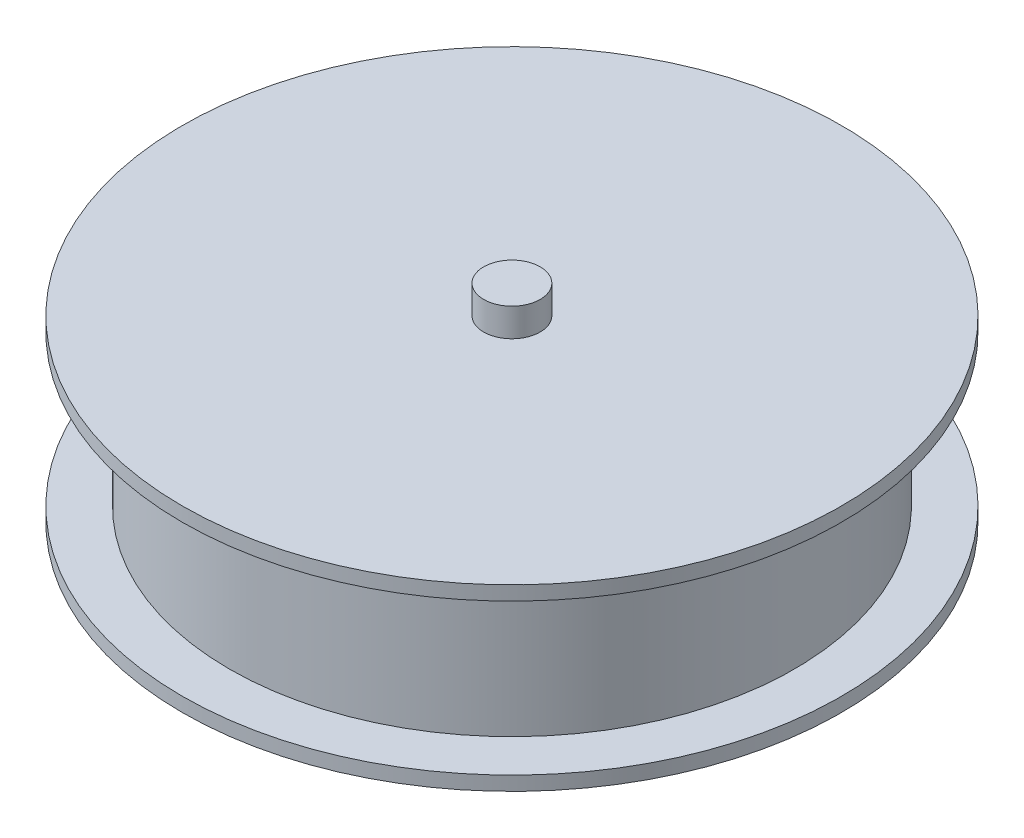
ISO-10303-21;
HEADER;
FILE_DESCRIPTION(('STEP AP214'),'2;1');
FILE_NAME('part.step','',(''),(''),'','','');
FILE_SCHEMA(('AUTOMOTIVE_DESIGN { 1 0 10303 214 1 1 1 1 }'));
ENDSEC;
DATA;
#1=APPLICATION_CONTEXT('core data for automotive mechanical design processes');
#2=APPLICATION_PROTOCOL_DEFINITION('international standard','automotive_design',2000,#1);
#3=PRODUCT_CONTEXT('',#1,'mechanical');
#4=PRODUCT('Part','Part','',(#3));
#5=PRODUCT_RELATED_PRODUCT_CATEGORY('part','',(#4));
#6=PRODUCT_DEFINITION_FORMATION('','',#4);
#7=PRODUCT_DEFINITION_CONTEXT('part definition',#1,'design');
#8=PRODUCT_DEFINITION('design','',#6,#7);
#9=PRODUCT_DEFINITION_SHAPE('','',#8);
#10=(LENGTH_UNIT() NAMED_UNIT(*) SI_UNIT(.MILLI.,.METRE.));
#11=(NAMED_UNIT(*) PLANE_ANGLE_UNIT() SI_UNIT($,.RADIAN.));
#12=(NAMED_UNIT(*) SI_UNIT($,.STERADIAN.) SOLID_ANGLE_UNIT());
#13=UNCERTAINTY_MEASURE_WITH_UNIT(LENGTH_MEASURE(1.E-05),#10,'distance_accuracy_value','');
#14=(GEOMETRIC_REPRESENTATION_CONTEXT(3) GLOBAL_UNCERTAINTY_ASSIGNED_CONTEXT((#13)) GLOBAL_UNIT_ASSIGNED_CONTEXT((#10,
#11,#12)) REPRESENTATION_CONTEXT('',''));
#15=CARTESIAN_POINT('',(0.,0.,0.));
#16=DIRECTION('',(0.,0.,1.));
#17=DIRECTION('',(1.,0.,0.));
#18=AXIS2_PLACEMENT_3D('',#15,#16,#17);
#19=CARTESIAN_POINT('',(0.,22.,0.));
#20=DIRECTION('',(0.,-1.,0.));
#21=DIRECTION('',(0.,0.,-1.));
#22=AXIS2_PLACEMENT_3D('',#19,#20,#21);
#23=CYLINDRICAL_SURFACE('',#22,3.);
#24=CARTESIAN_POINT('',(0.,22.,0.));
#25=DIRECTION('',(0.,1.,0.));
#26=DIRECTION('',(0.,0.,1.));
#27=AXIS2_PLACEMENT_3D('',#24,#25,#26);
#28=CIRCLE('',#27,3.);
#29=CARTESIAN_POINT('',(0.,22.,3.));
#30=VERTEX_POINT('',#29);
#31=EDGE_CURVE('E11',#30,#30,#28,.T.);
#32=ORIENTED_EDGE('',*,*,#31,.F.);
#33=EDGE_LOOP('',(#32));
#34=FACE_BOUND('',#33,.T.);
#35=CARTESIAN_POINT('',(0.,19.,0.));
#36=DIRECTION('',(0.,1.,0.));
#37=DIRECTION('',(0.,0.,1.));
#38=AXIS2_PLACEMENT_3D('',#35,#36,#37);
#39=CIRCLE('',#38,3.);
#40=CARTESIAN_POINT('',(0.,19.,3.));
#41=VERTEX_POINT('',#40);
#42=EDGE_CURVE('E52',#41,#41,#39,.T.);
#43=ORIENTED_EDGE('',*,*,#42,.T.);
#44=EDGE_LOOP('',(#43));
#45=FACE_BOUND('',#44,.T.);
#46=ADVANCED_FACE('F49',(#34,#45),#23,.T.);
#47=CARTESIAN_POINT('',(0.,22.,0.));
#48=DIRECTION('',(0.,1.,0.));
#49=DIRECTION('',(0.,0.,1.));
#50=AXIS2_PLACEMENT_3D('',#47,#48,#49);
#51=PLANE('',#50);
#52=ORIENTED_EDGE('',*,*,#31,.T.);
#53=EDGE_LOOP('',(#52));
#54=FACE_BOUND('',#53,.T.);
#55=ADVANCED_FACE('F64',(#54),#51,.T.);
#56=CARTESIAN_POINT('',(0.,19.,0.));
#57=DIRECTION('',(0.,1.,0.));
#58=DIRECTION('',(0.,0.,1.));
#59=AXIS2_PLACEMENT_3D('',#56,#57,#58);
#60=PLANE('',#59);
#61=ORIENTED_EDGE('',*,*,#42,.F.);
#62=EDGE_LOOP('',(#61));
#63=FACE_BOUND('',#62,.T.);
#64=ADVANCED_FACE('F62',(#63),#60,.F.);
#65=CLOSED_SHELL('',(#46,#55,#64));
#66=MANIFOLD_SOLID_BREP('B2',#65);
#67=CARTESIAN_POINT('',(0.,1.5,0.));
#68=DIRECTION('',(0.,-1.,0.));
#69=DIRECTION('',(0.,0.,-1.));
#70=AXIS2_PLACEMENT_3D('',#67,#68,#69);
#71=CYLINDRICAL_SURFACE('',#70,35.);
#72=CARTESIAN_POINT('',(0.,1.5,0.));
#73=DIRECTION('',(0.,1.,0.));
#74=DIRECTION('',(0.,0.,1.));
#75=AXIS2_PLACEMENT_3D('',#72,#73,#74);
#76=CIRCLE('',#75,35.);
#77=CARTESIAN_POINT('',(0.,1.5,35.));
#78=VERTEX_POINT('',#77);
#79=EDGE_CURVE('E104',#78,#78,#76,.T.);
#80=ORIENTED_EDGE('',*,*,#79,.F.);
#81=EDGE_LOOP('',(#80));
#82=FACE_BOUND('',#81,.T.);
#83=CARTESIAN_POINT('',(0.,0.,0.));
#84=DIRECTION('',(0.,1.,0.));
#85=DIRECTION('',(0.,0.,1.));
#86=AXIS2_PLACEMENT_3D('',#83,#84,#85);
#87=CIRCLE('',#86,35.);
#88=CARTESIAN_POINT('',(0.,0.,35.));
#89=VERTEX_POINT('',#88);
#90=EDGE_CURVE('E99',#89,#89,#87,.T.);
#91=ORIENTED_EDGE('',*,*,#90,.T.);
#92=EDGE_LOOP('',(#91));
#93=FACE_BOUND('',#92,.T.);
#94=ADVANCED_FACE('F96',(#82,#93),#71,.T.);
#95=CARTESIAN_POINT('',(0.,1.5,0.));
#96=DIRECTION('',(0.,1.,0.));
#97=DIRECTION('',(0.,0.,1.));
#98=AXIS2_PLACEMENT_3D('',#95,#96,#97);
#99=PLANE('',#98);
#100=CARTESIAN_POINT('',(0.,1.5,0.));
#101=DIRECTION('',(0.,1.,0.));
#102=DIRECTION('',(0.,0.,1.));
#103=AXIS2_PLACEMENT_3D('',#100,#101,#102);
#104=CIRCLE('',#103,30.);
#105=CARTESIAN_POINT('',(0.,1.5,30.));
#106=VERTEX_POINT('',#105);
#107=EDGE_CURVE('E48',#106,#106,#104,.T.);
#108=ORIENTED_EDGE('',*,*,#107,.F.);
#109=EDGE_LOOP('',(#108));
#110=FACE_BOUND('',#109,.T.);
#111=ORIENTED_EDGE('',*,*,#79,.T.);
#112=EDGE_LOOP('',(#111));
#113=FACE_BOUND('',#112,.T.);
#114=ADVANCED_FACE('F156',(#110,#113),#99,.T.);
#115=CARTESIAN_POINT('',(0.,0.,0.));
#116=DIRECTION('',(0.,1.,0.));
#117=DIRECTION('',(0.,0.,1.));
#118=AXIS2_PLACEMENT_3D('',#115,#116,#117);
#119=PLANE('',#118);
#120=CARTESIAN_POINT('',(0.,0.,0.));
#121=DIRECTION('',(0.,1.,0.));
#122=DIRECTION('',(0.,0.,1.));
#123=AXIS2_PLACEMENT_3D('',#120,#121,#122);
#124=CIRCLE('',#123,3.);
#125=CARTESIAN_POINT('',(0.,0.,3.));
#126=VERTEX_POINT('',#125);
#127=EDGE_CURVE('E116',#126,#126,#124,.T.);
#128=ORIENTED_EDGE('',*,*,#127,.T.);
#129=EDGE_LOOP('',(#128));
#130=FACE_BOUND('',#129,.T.);
#131=ORIENTED_EDGE('',*,*,#90,.F.);
#132=EDGE_LOOP('',(#131));
#133=FACE_BOUND('',#132,.T.);
#134=ADVANCED_FACE('F153',(#130,#133),#119,.F.);
#135=CARTESIAN_POINT('',(0.,9.5,0.));
#136=DIRECTION('',(0.,-1.,0.));
#137=DIRECTION('',(0.,0.,-1.));
#138=AXIS2_PLACEMENT_3D('',#135,#136,#137);
#139=CYLINDRICAL_SURFACE('',#138,30.);
#140=ORIENTED_EDGE('',*,*,#107,.T.);
#141=EDGE_LOOP('',(#140));
#142=FACE_BOUND('',#141,.T.);
#143=CARTESIAN_POINT('',(0.,17.5,0.));
#144=DIRECTION('',(0.,1.,0.));
#145=DIRECTION('',(0.,0.,1.));
#146=AXIS2_PLACEMENT_3D('',#143,#144,#145);
#147=CIRCLE('',#146,30.);
#148=CARTESIAN_POINT('',(0.,17.5,30.));
#149=VERTEX_POINT('',#148);
#150=EDGE_CURVE('E120',#149,#149,#147,.T.);
#151=ORIENTED_EDGE('',*,*,#150,.F.);
#152=EDGE_LOOP('',(#151));
#153=FACE_BOUND('',#152,.T.);
#154=ADVANCED_FACE('F144',(#142,#153),#139,.T.);
#155=CARTESIAN_POINT('',(0.,17.5,0.));
#156=DIRECTION('',(0.,1.,0.));
#157=DIRECTION('',(0.,0.,-1.));
#158=AXIS2_PLACEMENT_3D('',#155,#156,#157);
#159=CYLINDRICAL_SURFACE('',#158,35.);
#160=CARTESIAN_POINT('',(0.,17.5,0.));
#161=DIRECTION('',(0.,1.,0.));
#162=DIRECTION('',(0.,0.,1.));
#163=AXIS2_PLACEMENT_3D('',#160,#161,#162);
#164=CIRCLE('',#163,35.);
#165=CARTESIAN_POINT('',(0.,17.5,35.));
#166=VERTEX_POINT('',#165);
#167=EDGE_CURVE('E115',#166,#166,#164,.T.);
#168=ORIENTED_EDGE('',*,*,#167,.T.);
#169=EDGE_LOOP('',(#168));
#170=FACE_BOUND('',#169,.T.);
#171=CARTESIAN_POINT('',(0.,19.,0.));
#172=DIRECTION('',(0.,1.,0.));
#173=DIRECTION('',(0.,0.,1.));
#174=AXIS2_PLACEMENT_3D('',#171,#172,#173);
#175=CIRCLE('',#174,35.);
#176=CARTESIAN_POINT('',(0.,19.,35.));
#177=VERTEX_POINT('',#176);
#178=EDGE_CURVE('E111',#177,#177,#175,.T.);
#179=ORIENTED_EDGE('',*,*,#178,.F.);
#180=EDGE_LOOP('',(#179));
#181=FACE_BOUND('',#180,.T.);
#182=ADVANCED_FACE('F142',(#170,#181),#159,.T.);
#183=CARTESIAN_POINT('',(0.,17.5,0.));
#184=DIRECTION('',(0.,-1.,0.));
#185=DIRECTION('',(0.,0.,1.));
#186=AXIS2_PLACEMENT_3D('',#183,#184,#185);
#187=PLANE('',#186);
#188=ORIENTED_EDGE('',*,*,#150,.T.);
#189=EDGE_LOOP('',(#188));
#190=FACE_BOUND('',#189,.T.);
#191=ORIENTED_EDGE('',*,*,#167,.F.);
#192=EDGE_LOOP('',(#191));
#193=FACE_BOUND('',#192,.T.);
#194=ADVANCED_FACE('F138',(#190,#193),#187,.T.);
#195=CARTESIAN_POINT('',(0.,19.,0.));
#196=DIRECTION('',(0.,-1.,0.));
#197=DIRECTION('',(0.,0.,1.));
#198=AXIS2_PLACEMENT_3D('',#195,#196,#197);
#199=PLANE('',#198);
#200=CARTESIAN_POINT('',(0.,19.,0.));
#201=DIRECTION('',(0.,1.,0.));
#202=DIRECTION('',(0.,0.,1.));
#203=AXIS2_PLACEMENT_3D('',#200,#201,#202);
#204=CIRCLE('',#203,3.);
#205=CARTESIAN_POINT('',(0.,19.,3.));
#206=VERTEX_POINT('',#205);
#207=EDGE_CURVE('E127',#206,#206,#204,.T.);
#208=ORIENTED_EDGE('',*,*,#207,.F.);
#209=EDGE_LOOP('',(#208));
#210=FACE_BOUND('',#209,.T.);
#211=ORIENTED_EDGE('',*,*,#178,.T.);
#212=EDGE_LOOP('',(#211));
#213=FACE_BOUND('',#212,.T.);
#214=ADVANCED_FACE('F135',(#210,#213),#199,.F.);
#215=CARTESIAN_POINT('',(0.,-61.,0.));
#216=DIRECTION('',(0.,1.,0.));
#217=DIRECTION('',(0.,0.,1.));
#218=AXIS2_PLACEMENT_3D('',#215,#216,#217);
#219=CYLINDRICAL_SURFACE('',#218,3.);
#220=ORIENTED_EDGE('',*,*,#207,.T.);
#221=EDGE_LOOP('',(#220));
#222=FACE_BOUND('',#221,.T.);
#223=ORIENTED_EDGE('',*,*,#127,.F.);
#224=EDGE_LOOP('',(#223));
#225=FACE_BOUND('',#224,.T.);
#226=ADVANCED_FACE('F132',(#222,#225),#219,.F.);
#227=CLOSED_SHELL('',(#94,#114,#134,#154,#182,#194,#214,#226));
#228=MANIFOLD_SOLID_BREP('B6',#227);
#229=ADVANCED_BREP_SHAPE_REPRESENTATION('',(#18,#66,#228),#14);
#230=SHAPE_DEFINITION_REPRESENTATION(#9,#229);
ENDSEC;
END-ISO-10303-21;
